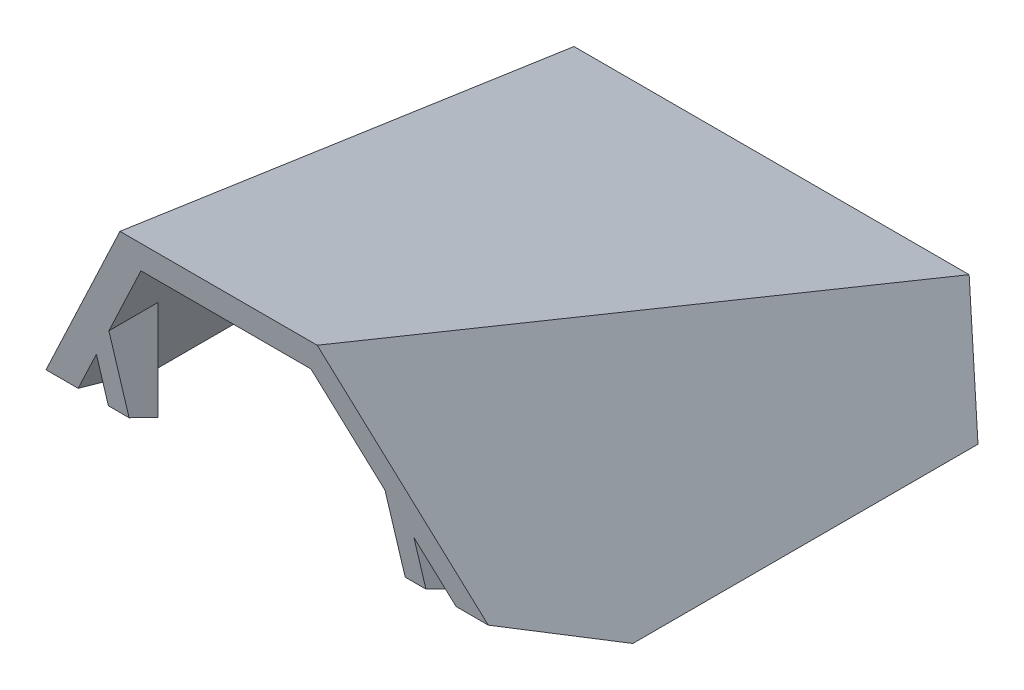
ISO-10303-21;
HEADER;
FILE_DESCRIPTION(('STEP AP214'),'2;1');
FILE_NAME('part.step','',(''),(''),'','','');
FILE_SCHEMA(('AUTOMOTIVE_DESIGN { 1 0 10303 214 1 1 1 1 }'));
ENDSEC;
DATA;
#1=APPLICATION_CONTEXT('core data for automotive mechanical design processes');
#2=APPLICATION_PROTOCOL_DEFINITION('international standard','automotive_design',2000,#1);
#3=PRODUCT_CONTEXT('',#1,'mechanical');
#4=PRODUCT('Part','Part','',(#3));
#5=PRODUCT_RELATED_PRODUCT_CATEGORY('part','',(#4));
#6=PRODUCT_DEFINITION_FORMATION('','',#4);
#7=PRODUCT_DEFINITION_CONTEXT('part definition',#1,'design');
#8=PRODUCT_DEFINITION('design','',#6,#7);
#9=PRODUCT_DEFINITION_SHAPE('','',#8);
#10=(LENGTH_UNIT() NAMED_UNIT(*) SI_UNIT(.MILLI.,.METRE.));
#11=(NAMED_UNIT(*) PLANE_ANGLE_UNIT() SI_UNIT($,.RADIAN.));
#12=(NAMED_UNIT(*) SI_UNIT($,.STERADIAN.) SOLID_ANGLE_UNIT());
#13=UNCERTAINTY_MEASURE_WITH_UNIT(LENGTH_MEASURE(1.E-05),#10,'distance_accuracy_value','');
#14=(GEOMETRIC_REPRESENTATION_CONTEXT(3) GLOBAL_UNCERTAINTY_ASSIGNED_CONTEXT((#13)) GLOBAL_UNIT_ASSIGNED_CONTEXT((#10,
#11,#12)) REPRESENTATION_CONTEXT('',''));
#15=CARTESIAN_POINT('',(0.,0.,0.));
#16=DIRECTION('',(0.,0.,1.));
#17=DIRECTION('',(1.,0.,0.));
#18=AXIS2_PLACEMENT_3D('',#15,#16,#17);
#19=CARTESIAN_POINT('',(-0.01,6.,-101.));
#20=DIRECTION('',(0.,-0.449307214467537,-0.893377315039633));
#21=DIRECTION('',(0.,0.893377315039633,-0.449307214467537));
#22=AXIS2_PLACEMENT_3D('',#19,#20,#21);
#23=PLANE('',#22);
#24=DIRECTION('',(1.,0.,0.));
#25=VECTOR('',#24,1.);
#26=CARTESIAN_POINT('',(-0.01,6.,-101.));
#27=LINE('',#26,#25);
#28=CARTESIAN_POINT('',(0.59636623361174,6.,-101.));
#29=VERTEX_POINT('',#28);
#30=CARTESIAN_POINT('',(2.92501621554741,6.,-101.));
#31=VERTEX_POINT('',#30);
#32=EDGE_CURVE('E42',#29,#31,#27,.T.);
#33=ORIENTED_EDGE('',*,*,#32,.F.);
#34=DIRECTION('',(0.470208034687993,0.788455160917309,-0.396538602582038));
#35=VECTOR('',#34,1.);
#36=CARTESIAN_POINT('',(12.5695356039594,26.0768733967971,-111.097283543328));
#37=LINE('',#36,#35);
#38=CARTESIAN_POINT('',(4.69001284972885,12.8643165648816,-104.452278117061));
#39=VERTEX_POINT('',#38);
#40=EDGE_CURVE('E190',#29,#39,#37,.T.);
#41=ORIENTED_EDGE('',*,*,#40,.T.);
#42=DIRECTION('',(1.,0.,0.));
#43=VECTOR('',#42,1.);
#44=CARTESIAN_POINT('',(38.,12.8643165648816,-104.452278117061));
#45=LINE('',#44,#43);
#46=CARTESIAN_POINT('',(33.3099871502711,12.8643165648816,-104.452278117061));
#47=VERTEX_POINT('',#46);
#48=EDGE_CURVE('E184',#39,#47,#45,.T.);
#49=ORIENTED_EDGE('',*,*,#48,.T.);
#50=DIRECTION('',(0.470208034687993,-0.788455160917309,0.396538602582038));
#51=VECTOR('',#50,1.);
#52=CARTESIAN_POINT('',(25.4304643960406,26.0768733967971,-111.097283543328));
#53=LINE('',#52,#51);
#54=CARTESIAN_POINT('',(37.4036337663883,6.,-101.));
#55=VERTEX_POINT('',#54);
#56=EDGE_CURVE('E170',#47,#55,#53,.T.);
#57=ORIENTED_EDGE('',*,*,#56,.T.);
#58=CARTESIAN_POINT('',(35.0749837844526,6.,-101.));
#59=VERTEX_POINT('',#58);
#60=EDGE_CURVE('E11',#59,#55,#27,.T.);
#61=ORIENTED_EDGE('',*,*,#60,.F.);
#62=DIRECTION('',(0.470208034687993,-0.788455160917309,0.396538602582038));
#63=VECTOR('',#62,1.);
#64=CARTESIAN_POINT('',(23.616668669469,25.2135544723739,-110.663093627601));
#65=LINE('',#64,#63);
#66=CARTESIAN_POINT('',(32.0633352800172,11.049998364589,-103.539801112096));
#67=VERTEX_POINT('',#66);
#68=EDGE_CURVE('E255',#67,#59,#65,.T.);
#69=ORIENTED_EDGE('',*,*,#68,.F.);
#70=DIRECTION('',(1.,0.,0.));
#71=VECTOR('',#70,1.);
#72=CARTESIAN_POINT('',(38.,11.049998364589,-103.539801112096));
#73=LINE('',#72,#71);
#74=CARTESIAN_POINT('',(5.93666471998284,11.049998364589,-103.539801112096));
#75=VERTEX_POINT('',#74);
#76=EDGE_CURVE('E251',#75,#67,#73,.T.);
#77=ORIENTED_EDGE('',*,*,#76,.F.);
#78=DIRECTION('',(0.470208034687993,0.788455160917309,-0.396538602582038));
#79=VECTOR('',#78,1.);
#80=CARTESIAN_POINT('',(14.383331330531,25.2135544723739,-110.663093627601));
#81=LINE('',#80,#79);
#82=EDGE_CURVE('E267',#31,#75,#81,.T.);
#83=ORIENTED_EDGE('',*,*,#82,.F.);
#84=EDGE_LOOP('',(#33,#41,#49,#57,#61,#69,#77,#83));
#85=FACE_BOUND('',#84,.T.);
#86=ADVANCED_FACE('F33',(#85),#23,.T.);
#87=CARTESIAN_POINT('',(-0.01,6.,-76.));
#88=DIRECTION('',(0.,-1.,0.));
#89=DIRECTION('',(0.,0.,-1.));
#90=AXIS2_PLACEMENT_3D('',#87,#88,#89);
#91=PLANE('',#90);
#92=DIRECTION('',(0.,0.,-1.));
#93=VECTOR('',#92,1.);
#94=CARTESIAN_POINT('',(2.92501621554741,6.,-114.));
#95=LINE('',#94,#93);
#96=CARTESIAN_POINT('',(2.92501621554741,6.,-76.));
#97=VERTEX_POINT('',#96);
#98=EDGE_CURVE('E270',#97,#31,#95,.T.);
#99=ORIENTED_EDGE('',*,*,#98,.F.);
#100=DIRECTION('',(1.,0.,0.));
#101=VECTOR('',#100,1.);
#102=CARTESIAN_POINT('',(-0.01,6.,-76.));
#103=LINE('',#102,#101);
#104=CARTESIAN_POINT('',(0.596366233611738,6.,-76.));
#105=VERTEX_POINT('',#104);
#106=EDGE_CURVE('E235',#105,#97,#103,.T.);
#107=ORIENTED_EDGE('',*,*,#106,.F.);
#108=DIRECTION('',(0.,0.,-1.));
#109=VECTOR('',#108,1.);
#110=CARTESIAN_POINT('',(0.596366233611739,6.,-114.));
#111=LINE('',#110,#109);
#112=EDGE_CURVE('E194',#105,#29,#111,.T.);
#113=ORIENTED_EDGE('',*,*,#112,.T.);
#114=ORIENTED_EDGE('',*,*,#32,.T.);
#115=EDGE_LOOP('',(#99,#107,#113,#114));
#116=FACE_BOUND('',#115,.T.);
#117=ADVANCED_FACE('F298',(#116),#91,.T.);
#118=DIRECTION('',(0.,0.,1.));
#119=VECTOR('',#118,1.);
#120=CARTESIAN_POINT('',(35.0749837844526,6.,-114.));
#121=LINE('',#120,#119);
#122=CARTESIAN_POINT('',(35.0749837844526,6.,-76.));
#123=VERTEX_POINT('',#122);
#124=EDGE_CURVE('E258',#59,#123,#121,.T.);
#125=ORIENTED_EDGE('',*,*,#124,.F.);
#126=ORIENTED_EDGE('',*,*,#60,.T.);
#127=DIRECTION('',(0.,0.,1.));
#128=VECTOR('',#127,1.);
#129=CARTESIAN_POINT('',(37.4036337663883,6.,-114.));
#130=LINE('',#129,#128);
#131=CARTESIAN_POINT('',(37.4036337663883,6.,-76.));
#132=VERTEX_POINT('',#131);
#133=EDGE_CURVE('E196',#55,#132,#130,.T.);
#134=ORIENTED_EDGE('',*,*,#133,.T.);
#135=EDGE_CURVE('E233',#123,#132,#103,.T.);
#136=ORIENTED_EDGE('',*,*,#135,.F.);
#137=EDGE_LOOP('',(#125,#126,#134,#136));
#138=FACE_BOUND('',#137,.T.);
#139=ADVANCED_FACE('F350',(#138),#91,.T.);
#140=CARTESIAN_POINT('',(-0.01,10.,-67.915898322201));
#141=DIRECTION('',(0.,-0.896284284960859,0.443479966325652));
#142=DIRECTION('',(0.,-0.443479966325652,-0.896284284960859));
#143=AXIS2_PLACEMENT_3D('',#140,#141,#142);
#144=PLANE('',#143);
#145=DIRECTION('',(0.,-0.443479966325652,-0.896284284960859));
#146=VECTOR('',#145,1.);
#147=CARTESIAN_POINT('',(8.99999999999999,12.1221132261488,-63.6270535492038));
#148=LINE('',#147,#146);
#149=CARTESIAN_POINT('',(8.99999999999999,10.,-67.915898322201));
#150=VERTEX_POINT('',#149);
#151=CARTESIAN_POINT('',(8.99999999999999,8.96878997278203,-70.));
#152=VERTEX_POINT('',#151);
#153=EDGE_CURVE('E279',#150,#152,#148,.T.);
#154=ORIENTED_EDGE('',*,*,#153,.F.);
#155=DIRECTION('',(1.,0.,0.));
#156=VECTOR('',#155,1.);
#157=CARTESIAN_POINT('',(-0.01,10.,-67.915898322201));
#158=LINE('',#157,#156);
#159=CARTESIAN_POINT('',(7.5,10.,-67.915898322201));
#160=VERTEX_POINT('',#159);
#161=EDGE_CURVE('E309',#160,#150,#158,.T.);
#162=ORIENTED_EDGE('',*,*,#161,.F.);
#163=DIRECTION('',(0.,0.443479966325652,0.896284284960859));
#164=VECTOR('',#163,1.);
#165=CARTESIAN_POINT('',(7.49999999999999,30.0088988292182,-27.4774051731529));
#166=LINE('',#165,#164);
#167=CARTESIAN_POINT('',(7.5,8.96878997278203,-70.));
#168=VERTEX_POINT('',#167);
#169=EDGE_CURVE('E175',#168,#160,#166,.T.);
#170=ORIENTED_EDGE('',*,*,#169,.F.);
#171=DIRECTION('',(-1.,0.,0.));
#172=VECTOR('',#171,1.);
#173=CARTESIAN_POINT('',(30.5,8.96878997278203,-70.));
#174=LINE('',#173,#172);
#175=EDGE_CURVE('E242',#152,#168,#174,.T.);
#176=ORIENTED_EDGE('',*,*,#175,.F.);
#177=EDGE_LOOP('',(#154,#162,#170,#176));
#178=FACE_BOUND('',#177,.T.);
#179=ADVANCED_FACE('F349',(#178),#144,.T.);
#180=CARTESIAN_POINT('',(-0.01,24.8805785955534,-64.3980713481553));
#181=DIRECTION('',(0.,-0.230062573986375,0.97317583819717));
#182=DIRECTION('',(0.,-0.97317583819717,-0.230062573986375));
#183=AXIS2_PLACEMENT_3D('',#180,#181,#182);
#184=PLANE('',#183);
#185=DIRECTION('',(-1.,0.,0.));
#186=VECTOR('',#185,1.);
#187=CARTESIAN_POINT('',(38.,24.8805785955534,-64.3980713481553));
#188=LINE('',#187,#186);
#189=CARTESIAN_POINT('',(26.1438942209476,24.8805785955534,-64.3980713481553));
#190=VERTEX_POINT('',#189);
#191=CARTESIAN_POINT('',(11.8561057790524,24.8805785955534,-64.3980713481553));
#192=VERTEX_POINT('',#191);
#193=EDGE_CURVE('E178',#190,#192,#188,.T.);
#194=ORIENTED_EDGE('',*,*,#193,.T.);
#195=DIRECTION('',(-0.501957015820687,-0.841692549862712,-0.198979410427304));
#196=VECTOR('',#195,1.);
#197=CARTESIAN_POINT('',(6.97030837543245,16.6879661902026,-66.3348369599479));
#198=LINE('',#197,#196);
#199=CARTESIAN_POINT('',(2.9818311680587,10.,-67.915898322201));
#200=VERTEX_POINT('',#199);
#201=EDGE_CURVE('E290',#192,#200,#198,.T.);
#202=ORIENTED_EDGE('',*,*,#201,.T.);
#203=CARTESIAN_POINT('',(5.31048114999437,10.,-67.915898322201));
#204=VERTEX_POINT('',#203);
#205=EDGE_CURVE('E229',#200,#204,#158,.T.);
#206=ORIENTED_EDGE('',*,*,#205,.T.);
#207=DIRECTION('',(-0.501957015820687,-0.841692549862712,-0.198979410427304));
#208=VECTOR('',#207,1.);
#209=CARTESIAN_POINT('',(8.71222973850671,15.7041267543109,-66.5674204501318));
#210=LINE('',#209,#208);
#211=CARTESIAN_POINT('',(7.5,13.6714333015559,-67.0479571316963));
#212=VERTEX_POINT('',#211);
#213=EDGE_CURVE('E276',#212,#204,#210,.T.);
#214=ORIENTED_EDGE('',*,*,#213,.F.);
#215=DIRECTION('',(0.,0.97317583819717,0.230062573986375));
#216=VECTOR('',#215,1.);
#217=CARTESIAN_POINT('',(7.5,33.8164602319023,-62.2855939834229));
#218=LINE('',#217,#216);
#219=EDGE_CURVE('E240',#160,#212,#218,.T.);
#220=ORIENTED_EDGE('',*,*,#219,.F.);
#221=ORIENTED_EDGE('',*,*,#161,.T.);
#222=DIRECTION('',(0.,-0.97317583819717,-0.230062573986375));
#223=VECTOR('',#222,1.);
#224=CARTESIAN_POINT('',(8.99999999999999,23.7413500094378,-64.6673894411385));
#225=LINE('',#224,#223);
#226=CARTESIAN_POINT('',(8.99999999999999,16.1866662497992,-66.4533462263124));
#227=VERTEX_POINT('',#226);
#228=EDGE_CURVE('E282',#227,#150,#225,.T.);
#229=ORIENTED_EDGE('',*,*,#228,.F.);
#230=CARTESIAN_POINT('',(12.844450484188,22.6331252669455,-64.9293781042413));
#231=VERTEX_POINT('',#230);
#232=EDGE_CURVE('E277',#231,#227,#210,.T.);
#233=ORIENTED_EDGE('',*,*,#232,.F.);
#234=DIRECTION('',(-1.,0.,0.));
#235=VECTOR('',#234,1.);
#236=CARTESIAN_POINT('',(38.,22.6331252669455,-64.9293781042413));
#237=LINE('',#236,#235);
#238=CARTESIAN_POINT('',(25.155549515812,22.6331252669455,-64.9293781042413));
#239=VERTEX_POINT('',#238);
#240=EDGE_CURVE('E253',#239,#231,#237,.T.);
#241=ORIENTED_EDGE('',*,*,#240,.F.);
#242=DIRECTION('',(-0.501957015820687,0.841692549862712,0.198979410427304));
#243=VECTOR('',#242,1.);
#244=CARTESIAN_POINT('',(29.2877702614933,15.7041267543109,-66.5674204501318));
#245=LINE('',#244,#243);
#246=CARTESIAN_POINT('',(29.,16.1866662497992,-66.4533462263124));
#247=VERTEX_POINT('',#246);
#248=EDGE_CURVE('E265',#247,#239,#245,.T.);
#249=ORIENTED_EDGE('',*,*,#248,.F.);
#250=DIRECTION('',(0.,0.97317583819717,0.230062573986375));
#251=VECTOR('',#250,1.);
#252=CARTESIAN_POINT('',(29.,23.7413500094378,-64.6673894411385));
#253=LINE('',#252,#251);
#254=CARTESIAN_POINT('',(29.,10.,-67.915898322201));
#255=VERTEX_POINT('',#254);
#256=EDGE_CURVE('E183',#255,#247,#253,.T.);
#257=ORIENTED_EDGE('',*,*,#256,.F.);
#258=CARTESIAN_POINT('',(30.5,10.,-67.915898322201));
#259=VERTEX_POINT('',#258);
#260=EDGE_CURVE('E237',#255,#259,#158,.T.);
#261=ORIENTED_EDGE('',*,*,#260,.T.);
#262=DIRECTION('',(0.,-0.97317583819717,-0.230062573986375));
#263=VECTOR('',#262,1.);
#264=CARTESIAN_POINT('',(30.5,33.8164602319023,-62.2855939834229));
#265=LINE('',#264,#263);
#266=CARTESIAN_POINT('',(30.5,13.671433301556,-67.0479571316963));
#267=VERTEX_POINT('',#266);
#268=EDGE_CURVE('E248',#267,#259,#265,.T.);
#269=ORIENTED_EDGE('',*,*,#268,.F.);
#270=CARTESIAN_POINT('',(32.6895188500056,10.,-67.915898322201));
#271=VERTEX_POINT('',#270);
#272=EDGE_CURVE('E264',#271,#267,#245,.T.);
#273=ORIENTED_EDGE('',*,*,#272,.F.);
#274=CARTESIAN_POINT('',(35.0181688319413,10.,-67.915898322201));
#275=VERTEX_POINT('',#274);
#276=EDGE_CURVE('E188',#271,#275,#158,.T.);
#277=ORIENTED_EDGE('',*,*,#276,.T.);
#278=DIRECTION('',(-0.501957015820687,0.841692549862712,0.198979410427304));
#279=VECTOR('',#278,1.);
#280=CARTESIAN_POINT('',(31.0296916245676,16.6879661902026,-66.3348369599479));
#281=LINE('',#280,#279);
#282=EDGE_CURVE('E167',#275,#190,#281,.T.);
#283=ORIENTED_EDGE('',*,*,#282,.T.);
#284=EDGE_LOOP('',(#194,#202,#206,#214,#220,#221,#229,#233,#241,#249,#257,#261,#269,#273,#277,#283));
#285=FACE_BOUND('',#284,.T.);
#286=ADVANCED_FACE('F186',(#285),#184,.T.);
#287=DIRECTION('',(-0.255685297053611,-0.428738722353743,-0.866491856179321));
#288=VECTOR('',#287,1.);
#289=CARTESIAN_POINT('',(-2.82250721530041,-3.63757353604583,-95.4777810981648));
#290=LINE('',#289,#288);
#291=EDGE_CURVE('E273',#204,#97,#290,.T.);
#292=ORIENTED_EDGE('',*,*,#291,.F.);
#293=ORIENTED_EDGE('',*,*,#205,.F.);
#294=DIRECTION('',(-0.255685297053611,-0.428738722353743,-0.866491856179321));
#295=VECTOR('',#294,1.);
#296=CARTESIAN_POINT('',(-4.99892177189657,-3.38230183090998,-94.961870493219));
#297=LINE('',#296,#295);
#298=EDGE_CURVE('E292',#200,#105,#297,.T.);
#299=ORIENTED_EDGE('',*,*,#298,.T.);
#300=ORIENTED_EDGE('',*,*,#106,.T.);
#301=EDGE_LOOP('',(#292,#293,#299,#300));
#302=FACE_BOUND('',#301,.T.);
#303=ADVANCED_FACE('F306',(#302),#144,.T.);
#304=DIRECTION('',(0.,0.443479966325652,0.896284284960859));
#305=VECTOR('',#304,1.);
#306=CARTESIAN_POINT('',(29.,12.1221132261488,-63.6270535492038));
#307=LINE('',#306,#305);
#308=CARTESIAN_POINT('',(29.,8.96878997278203,-70.));
#309=VERTEX_POINT('',#308);
#310=EDGE_CURVE('E285',#309,#255,#307,.T.);
#311=ORIENTED_EDGE('',*,*,#310,.F.);
#312=CARTESIAN_POINT('',(30.5,8.96878997278203,-70.));
#313=VERTEX_POINT('',#312);
#314=EDGE_CURVE('E243',#313,#309,#174,.T.);
#315=ORIENTED_EDGE('',*,*,#314,.F.);
#316=DIRECTION('',(0.,-0.443479966325652,-0.896284284960859));
#317=VECTOR('',#316,1.);
#318=CARTESIAN_POINT('',(30.5,30.0088988292182,-27.4774051731528));
#319=LINE('',#318,#317);
#320=EDGE_CURVE('E245',#259,#313,#319,.T.);
#321=ORIENTED_EDGE('',*,*,#320,.F.);
#322=ORIENTED_EDGE('',*,*,#260,.F.);
#323=EDGE_LOOP('',(#311,#315,#321,#322));
#324=FACE_BOUND('',#323,.T.);
#325=ADVANCED_FACE('F317',(#324),#144,.T.);
#326=DIRECTION('',(-0.255685297053611,0.428738722353743,0.866491856179321));
#327=VECTOR('',#326,1.);
#328=CARTESIAN_POINT('',(40.8225072153004,-3.63757353604583,-95.4777810981648));
#329=LINE('',#328,#327);
#330=EDGE_CURVE('E261',#123,#271,#329,.T.);
#331=ORIENTED_EDGE('',*,*,#330,.F.);
#332=ORIENTED_EDGE('',*,*,#135,.T.);
#333=DIRECTION('',(-0.255685297053611,0.428738722353743,0.866491856179321));
#334=VECTOR('',#333,1.);
#335=CARTESIAN_POINT('',(42.9989217718966,-3.38230183090998,-94.961870493219));
#336=LINE('',#335,#334);
#337=EDGE_CURVE('E191',#132,#275,#336,.T.);
#338=ORIENTED_EDGE('',*,*,#337,.T.);
#339=ORIENTED_EDGE('',*,*,#276,.F.);
#340=EDGE_LOOP('',(#331,#332,#338,#339));
#341=FACE_BOUND('',#340,.T.);
#342=ADVANCED_FACE('F339',(#341),#144,.T.);
#343=CARTESIAN_POINT('',(8.99999999999999,25.002,-70.));
#344=DIRECTION('',(1.,0.,0.));
#345=DIRECTION('',(0.,0.,-1.));
#346=AXIS2_PLACEMENT_3D('',#343,#344,#345);
#347=PLANE('',#346);
#348=DIRECTION('',(0.,0.,-1.));
#349=VECTOR('',#348,1.);
#350=CARTESIAN_POINT('',(8.99999999999999,16.1866662497992,-70.));
#351=LINE('',#350,#349);
#352=CARTESIAN_POINT('',(8.99999999999999,16.1866662497992,-70.));
#353=VERTEX_POINT('',#352);
#354=EDGE_CURVE('E225',#227,#353,#351,.T.);
#355=ORIENTED_EDGE('',*,*,#354,.F.);
#356=ORIENTED_EDGE('',*,*,#228,.T.);
#357=ORIENTED_EDGE('',*,*,#153,.T.);
#358=DIRECTION('',(0.,-1.,0.));
#359=VECTOR('',#358,1.);
#360=CARTESIAN_POINT('',(8.99999999999999,25.002,-70.));
#361=LINE('',#360,#359);
#362=EDGE_CURVE('E215',#353,#152,#361,.T.);
#363=ORIENTED_EDGE('',*,*,#362,.F.);
#364=EDGE_LOOP('',(#355,#356,#357,#363));
#365=FACE_BOUND('',#364,.T.);
#366=ADVANCED_FACE('F336',(#365),#347,.T.);
#367=CARTESIAN_POINT('',(30.5,25.002,-70.));
#368=DIRECTION('',(0.,0.,-1.));
#369=DIRECTION('',(-1.,0.,0.));
#370=AXIS2_PLACEMENT_3D('',#367,#368,#369);
#371=PLANE('',#370);
#372=ORIENTED_EDGE('',*,*,#362,.T.);
#373=ORIENTED_EDGE('',*,*,#175,.T.);
#374=DIRECTION('',(0.,-1.,0.));
#375=VECTOR('',#374,1.);
#376=CARTESIAN_POINT('',(7.5,25.002,-70.));
#377=LINE('',#376,#375);
#378=CARTESIAN_POINT('',(7.5,13.6714333015559,-70.));
#379=VERTEX_POINT('',#378);
#380=EDGE_CURVE('E218',#379,#168,#377,.T.);
#381=ORIENTED_EDGE('',*,*,#380,.F.);
#382=DIRECTION('',(-0.512199118148288,-0.858866732018487,0.));
#383=VECTOR('',#382,1.);
#384=CARTESIAN_POINT('',(12.484438465277,22.0294492057933,-70.));
#385=LINE('',#384,#383);
#386=EDGE_CURVE('E224',#353,#379,#385,.T.);
#387=ORIENTED_EDGE('',*,*,#386,.F.);
#388=EDGE_LOOP('',(#372,#373,#381,#387));
#389=FACE_BOUND('',#388,.T.);
#390=ADVANCED_FACE('F338',(#389),#371,.T.);
#391=CARTESIAN_POINT('',(13.6450581362718,23.9756017637034,-114.));
#392=DIRECTION('',(0.858866732018487,-0.512199118148288,0.));
#393=DIRECTION('',(0.512199118148288,0.858866732018487,0.));
#394=AXIS2_PLACEMENT_3D('',#391,#392,#393);
#395=PLANE('',#394);
#396=DIRECTION('',(0.168902539776426,0.283219488725093,0.944064962416978));
#397=VECTOR('',#396,1.);
#398=CARTESIAN_POINT('',(5.1332107915877,9.70274916919243,-108.030631763418));
#399=LINE('',#398,#397);
#400=EDGE_CURVE('E207',#75,#231,#399,.T.);
#401=ORIENTED_EDGE('',*,*,#400,.T.);
#402=ORIENTED_EDGE('',*,*,#232,.T.);
#403=ORIENTED_EDGE('',*,*,#354,.T.);
#404=ORIENTED_EDGE('',*,*,#386,.T.);
#405=DIRECTION('',(0.,0.,1.));
#406=VECTOR('',#405,1.);
#407=CARTESIAN_POINT('',(7.49999999999999,13.6714333015559,-25.));
#408=LINE('',#407,#406);
#409=EDGE_CURVE('E221',#379,#212,#408,.T.);
#410=ORIENTED_EDGE('',*,*,#409,.T.);
#411=ORIENTED_EDGE('',*,*,#213,.T.);
#412=ORIENTED_EDGE('',*,*,#291,.T.);
#413=ORIENTED_EDGE('',*,*,#98,.T.);
#414=ORIENTED_EDGE('',*,*,#82,.T.);
#415=EDGE_LOOP('',(#401,#402,#403,#404,#410,#411,#412,#413,#414));
#416=FACE_BOUND('',#415,.T.);
#417=ADVANCED_FACE('F345',(#416),#395,.T.);
#418=CARTESIAN_POINT('',(7.49999999999999,25.002,-25.));
#419=DIRECTION('',(-1.,0.,0.));
#420=DIRECTION('',(0.,0.,1.));
#421=AXIS2_PLACEMENT_3D('',#418,#419,#420);
#422=PLANE('',#421);
#423=ORIENTED_EDGE('',*,*,#169,.T.);
#424=ORIENTED_EDGE('',*,*,#219,.T.);
#425=ORIENTED_EDGE('',*,*,#409,.F.);
#426=ORIENTED_EDGE('',*,*,#380,.T.);
#427=EDGE_LOOP('',(#423,#424,#425,#426));
#428=FACE_BOUND('',#427,.T.);
#429=ADVANCED_FACE('F332',(#428),#422,.T.);
#430=CARTESIAN_POINT('',(24.3549418637282,23.9756017637034,-114.));
#431=DIRECTION('',(-0.858866732018487,-0.512199118148288,0.));
#432=DIRECTION('',(0.512199118148288,-0.858866732018487,0.));
#433=AXIS2_PLACEMENT_3D('',#430,#431,#432);
#434=PLANE('',#433);
#435=DIRECTION('',(0.,0.,1.));
#436=VECTOR('',#435,1.);
#437=CARTESIAN_POINT('',(29.,16.1866662497992,-70.));
#438=LINE('',#437,#436);
#439=CARTESIAN_POINT('',(29.,16.1866662497992,-70.));
#440=VERTEX_POINT('',#439);
#441=EDGE_CURVE('E57',#440,#247,#438,.T.);
#442=ORIENTED_EDGE('',*,*,#441,.T.);
#443=ORIENTED_EDGE('',*,*,#248,.T.);
#444=DIRECTION('',(0.168902539776426,-0.283219488725093,-0.944064962416978));
#445=VECTOR('',#444,1.);
#446=CARTESIAN_POINT('',(33.9508557902435,7.88496251271816,-114.089920618332));
#447=LINE('',#446,#445);
#448=EDGE_CURVE('E204',#239,#67,#447,.T.);
#449=ORIENTED_EDGE('',*,*,#448,.T.);
#450=ORIENTED_EDGE('',*,*,#68,.T.);
#451=ORIENTED_EDGE('',*,*,#124,.T.);
#452=ORIENTED_EDGE('',*,*,#330,.T.);
#453=ORIENTED_EDGE('',*,*,#272,.T.);
#454=DIRECTION('',(0.,0.,-1.));
#455=VECTOR('',#454,1.);
#456=CARTESIAN_POINT('',(30.5,13.671433301556,-25.));
#457=LINE('',#456,#455);
#458=CARTESIAN_POINT('',(30.5,13.671433301556,-70.));
#459=VERTEX_POINT('',#458);
#460=EDGE_CURVE('E37',#267,#459,#457,.T.);
#461=ORIENTED_EDGE('',*,*,#460,.T.);
#462=DIRECTION('',(-0.512199118148288,0.858866732018487,0.));
#463=VECTOR('',#462,1.);
#464=CARTESIAN_POINT('',(25.515561534723,22.0294492057933,-70.));
#465=LINE('',#464,#463);
#466=EDGE_CURVE('E226',#459,#440,#465,.T.);
#467=ORIENTED_EDGE('',*,*,#466,.T.);
#468=EDGE_LOOP('',(#442,#443,#449,#450,#451,#452,#453,#461,#467));
#469=FACE_BOUND('',#468,.T.);
#470=ADVANCED_FACE('F325',(#469),#434,.T.);
#471=CARTESIAN_POINT('',(29.,25.002,-70.));
#472=DIRECTION('',(-1.,0.,0.));
#473=DIRECTION('',(0.,0.,1.));
#474=AXIS2_PLACEMENT_3D('',#471,#472,#473);
#475=PLANE('',#474);
#476=ORIENTED_EDGE('',*,*,#310,.T.);
#477=ORIENTED_EDGE('',*,*,#256,.T.);
#478=ORIENTED_EDGE('',*,*,#441,.F.);
#479=DIRECTION('',(0.,-1.,0.));
#480=VECTOR('',#479,1.);
#481=CARTESIAN_POINT('',(29.,25.002,-70.));
#482=LINE('',#481,#480);
#483=EDGE_CURVE('E213',#440,#309,#482,.T.);
#484=ORIENTED_EDGE('',*,*,#483,.T.);
#485=EDGE_LOOP('',(#476,#477,#478,#484));
#486=FACE_BOUND('',#485,.T.);
#487=ADVANCED_FACE('F323',(#486),#475,.T.);
#488=CARTESIAN_POINT('',(30.5,25.002,-25.));
#489=DIRECTION('',(1.,0.,0.));
#490=DIRECTION('',(0.,0.,-1.));
#491=AXIS2_PLACEMENT_3D('',#488,#489,#490);
#492=PLANE('',#491);
#493=ORIENTED_EDGE('',*,*,#460,.F.);
#494=ORIENTED_EDGE('',*,*,#268,.T.);
#495=ORIENTED_EDGE('',*,*,#320,.T.);
#496=DIRECTION('',(0.,-1.,0.));
#497=VECTOR('',#496,1.);
#498=CARTESIAN_POINT('',(30.5,25.002,-70.));
#499=LINE('',#498,#497);
#500=EDGE_CURVE('E210',#459,#313,#499,.T.);
#501=ORIENTED_EDGE('',*,*,#500,.F.);
#502=EDGE_LOOP('',(#493,#494,#495,#501));
#503=FACE_BOUND('',#502,.T.);
#504=ADVANCED_FACE('F320',(#503),#492,.T.);
#505=ORIENTED_EDGE('',*,*,#500,.T.);
#506=ORIENTED_EDGE('',*,*,#314,.T.);
#507=ORIENTED_EDGE('',*,*,#483,.F.);
#508=ORIENTED_EDGE('',*,*,#466,.F.);
#509=EDGE_LOOP('',(#505,#506,#507,#508));
#510=FACE_BOUND('',#509,.T.);
#511=ADVANCED_FACE('F322',(#510),#371,.T.);
#512=CARTESIAN_POINT('',(38.,8.0843474295577,-113.425304228867));
#513=DIRECTION('',(0.,-0.957826285221151,0.287347885566345));
#514=DIRECTION('',(0.,-0.287347885566345,-0.957826285221151));
#515=AXIS2_PLACEMENT_3D('',#512,#513,#514);
#516=PLANE('',#515);
#517=ORIENTED_EDGE('',*,*,#448,.F.);
#518=ORIENTED_EDGE('',*,*,#240,.T.);
#519=ORIENTED_EDGE('',*,*,#400,.F.);
#520=ORIENTED_EDGE('',*,*,#76,.T.);
#521=EDGE_LOOP('',(#517,#518,#519,#520));
#522=FACE_BOUND('',#521,.T.);
#523=ADVANCED_FACE('F35',(#522),#516,.T.);
#524=CARTESIAN_POINT('',(38.,10.,-114.));
#525=DIRECTION('',(0.,-0.957826285221151,0.287347885566345));
#526=DIRECTION('',(0.,-0.287347885566345,-0.957826285221151));
#527=AXIS2_PLACEMENT_3D('',#524,#525,#526);
#528=PLANE('',#527);
#529=ORIENTED_EDGE('',*,*,#193,.F.);
#530=DIRECTION('',(0.168902539776426,-0.283219488725093,-0.944064962416978));
#531=VECTOR('',#530,1.);
#532=CARTESIAN_POINT('',(35.103234714098,9.85735966028536,-114.475467799049));
#533=LINE('',#532,#531);
#534=EDGE_CURVE('E162',#190,#47,#533,.T.);
#535=ORIENTED_EDGE('',*,*,#534,.T.);
#536=ORIENTED_EDGE('',*,*,#48,.F.);
#537=DIRECTION('',(0.168902539776426,0.283219488725093,0.944064962416978));
#538=VECTOR('',#537,1.);
#539=CARTESIAN_POINT('',(3.98083186773322,11.6751463167596,-108.416178944135));
#540=LINE('',#539,#538);
#541=EDGE_CURVE('E174',#39,#192,#540,.T.);
#542=ORIENTED_EDGE('',*,*,#541,.T.);
#543=EDGE_LOOP('',(#529,#535,#536,#542));
#544=FACE_BOUND('',#543,.T.);
#545=ADVANCED_FACE('F179',(#544),#528,.F.);
#546=CARTESIAN_POINT('',(11.9273246722348,25.,-114.));
#547=DIRECTION('',(0.858866732018487,-0.512199118148288,0.));
#548=DIRECTION('',(0.512199118148288,0.858866732018487,0.));
#549=AXIS2_PLACEMENT_3D('',#546,#547,#548);
#550=PLANE('',#549);
#551=ORIENTED_EDGE('',*,*,#201,.F.);
#552=ORIENTED_EDGE('',*,*,#541,.F.);
#553=ORIENTED_EDGE('',*,*,#40,.F.);
#554=ORIENTED_EDGE('',*,*,#112,.F.);
#555=ORIENTED_EDGE('',*,*,#298,.F.);
#556=EDGE_LOOP('',(#551,#552,#553,#554,#555));
#557=FACE_BOUND('',#556,.T.);
#558=ADVANCED_FACE('F303',(#557),#550,.F.);
#559=CARTESIAN_POINT('',(26.0726753277652,25.,-114.));
#560=DIRECTION('',(-0.858866732018487,-0.512199118148288,0.));
#561=DIRECTION('',(0.512199118148288,-0.858866732018487,0.));
#562=AXIS2_PLACEMENT_3D('',#559,#560,#561);
#563=PLANE('',#562);
#564=ORIENTED_EDGE('',*,*,#282,.F.);
#565=ORIENTED_EDGE('',*,*,#337,.F.);
#566=ORIENTED_EDGE('',*,*,#133,.F.);
#567=ORIENTED_EDGE('',*,*,#56,.F.);
#568=ORIENTED_EDGE('',*,*,#534,.F.);
#569=EDGE_LOOP('',(#564,#565,#566,#567,#568));
#570=FACE_BOUND('',#569,.T.);
#571=ADVANCED_FACE('F164',(#570),#563,.F.);
#572=CLOSED_SHELL('',(#86,#117,#139,#179,#286,#303,#325,#342,#366,#390,#417,#429,#470,#487,#504,
#511,#523,#545,#558,#571));
#573=MANIFOLD_SOLID_BREP('B2',#572);
#574=ADVANCED_BREP_SHAPE_REPRESENTATION('',(#18,#573),#14);
#575=SHAPE_DEFINITION_REPRESENTATION(#9,#574);
ENDSEC;
END-ISO-10303-21;
